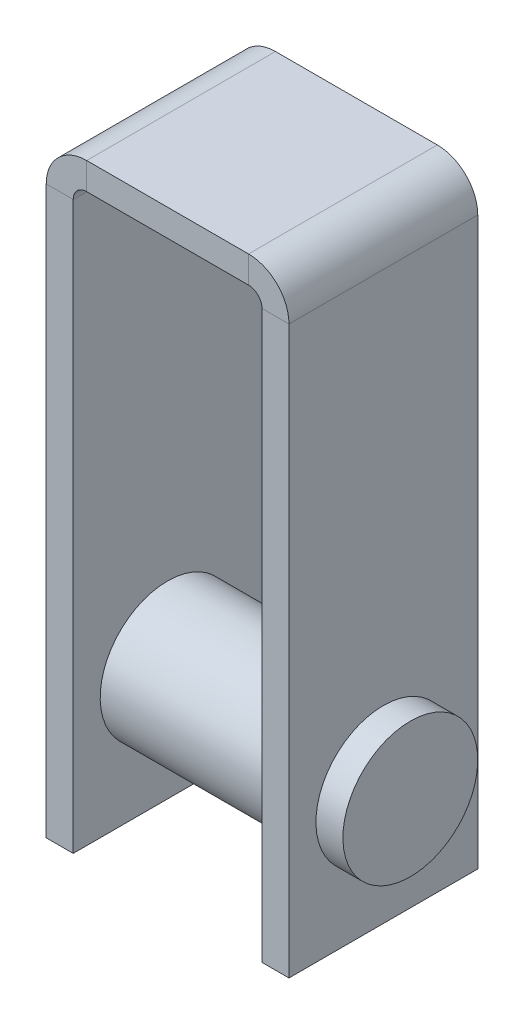
ISO-10303-21;
HEADER;
FILE_DESCRIPTION(('STEP AP214'),'2;1');
FILE_NAME('part.step','',(''),(''),'','','');
FILE_SCHEMA(('AUTOMOTIVE_DESIGN { 1 0 10303 214 1 1 1 1 }'));
ENDSEC;
DATA;
#1=APPLICATION_CONTEXT('core data for automotive mechanical design processes');
#2=APPLICATION_PROTOCOL_DEFINITION('international standard','automotive_design',2000,#1);
#3=PRODUCT_CONTEXT('',#1,'mechanical');
#4=PRODUCT('Part','Part','',(#3));
#5=PRODUCT_RELATED_PRODUCT_CATEGORY('part','',(#4));
#6=PRODUCT_DEFINITION_FORMATION('','',#4);
#7=PRODUCT_DEFINITION_CONTEXT('part definition',#1,'design');
#8=PRODUCT_DEFINITION('design','',#6,#7);
#9=PRODUCT_DEFINITION_SHAPE('','',#8);
#10=(LENGTH_UNIT() NAMED_UNIT(*) SI_UNIT(.MILLI.,.METRE.));
#11=(NAMED_UNIT(*) PLANE_ANGLE_UNIT() SI_UNIT($,.RADIAN.));
#12=(NAMED_UNIT(*) SI_UNIT($,.STERADIAN.) SOLID_ANGLE_UNIT());
#13=UNCERTAINTY_MEASURE_WITH_UNIT(LENGTH_MEASURE(1.E-05),#10,'distance_accuracy_value','');
#14=(GEOMETRIC_REPRESENTATION_CONTEXT(3) GLOBAL_UNCERTAINTY_ASSIGNED_CONTEXT((#13)) GLOBAL_UNIT_ASSIGNED_CONTEXT((#10,
#11,#12)) REPRESENTATION_CONTEXT('',''));
#15=CARTESIAN_POINT('',(0.,0.,0.));
#16=DIRECTION('',(0.,0.,1.));
#17=DIRECTION('',(1.,0.,0.));
#18=AXIS2_PLACEMENT_3D('',#15,#16,#17);
#19=CARTESIAN_POINT('',(-31.6451788984849,-220.,0.));
#20=DIRECTION('',(0.,-1.,0.));
#21=DIRECTION('',(0.,0.,1.));
#22=AXIS2_PLACEMENT_3D('',#19,#20,#21);
#23=PLANE('',#22);
#24=DIRECTION('',(-1.,0.,0.));
#25=VECTOR('',#24,1.);
#26=CARTESIAN_POINT('',(-26.6451788984849,-220.,-35.));
#27=LINE('',#26,#25);
#28=CARTESIAN_POINT('',(-26.6451788984849,-220.,-35.));
#29=VERTEX_POINT('',#28);
#30=CARTESIAN_POINT('',(-36.6451788984849,-220.,-35.));
#31=VERTEX_POINT('',#30);
#32=EDGE_CURVE('E148',#29,#31,#27,.T.);
#33=ORIENTED_EDGE('',*,*,#32,.F.);
#34=DIRECTION('',(0.,0.,-1.));
#35=VECTOR('',#34,1.);
#36=CARTESIAN_POINT('',(-26.6451788984849,-220.,35.));
#37=LINE('',#36,#35);
#38=CARTESIAN_POINT('',(-26.6451788984849,-220.,35.));
#39=VERTEX_POINT('',#38);
#40=EDGE_CURVE('E150',#39,#29,#37,.T.);
#41=ORIENTED_EDGE('',*,*,#40,.F.);
#42=DIRECTION('',(1.,0.,0.));
#43=VECTOR('',#42,1.);
#44=CARTESIAN_POINT('',(-26.6451788984849,-220.,35.));
#45=LINE('',#44,#43);
#46=CARTESIAN_POINT('',(-36.6451788984849,-220.,35.));
#47=VERTEX_POINT('',#46);
#48=EDGE_CURVE('E168',#47,#39,#45,.T.);
#49=ORIENTED_EDGE('',*,*,#48,.F.);
#50=DIRECTION('',(0.,0.,1.));
#51=VECTOR('',#50,1.);
#52=CARTESIAN_POINT('',(-36.6451788984849,-220.,35.));
#53=LINE('',#52,#51);
#54=EDGE_CURVE('E153',#31,#47,#53,.T.);
#55=ORIENTED_EDGE('',*,*,#54,.F.);
#56=EDGE_LOOP('',(#33,#41,#49,#55));
#57=FACE_BOUND('',#56,.T.);
#58=ADVANCED_FACE('F39',(#57),#23,.T.);
#59=CARTESIAN_POINT('',(48.3548211015151,-220.,0.));
#60=DIRECTION('',(0.,1.,0.));
#61=DIRECTION('',(0.,0.,1.));
#62=AXIS2_PLACEMENT_3D('',#59,#60,#61);
#63=PLANE('',#62);
#64=DIRECTION('',(1.,0.,0.));
#65=VECTOR('',#64,1.);
#66=CARTESIAN_POINT('',(43.3548211015151,-220.,-35.));
#67=LINE('',#66,#65);
#68=CARTESIAN_POINT('',(43.3548211015151,-220.,-35.));
#69=VERTEX_POINT('',#68);
#70=CARTESIAN_POINT('',(53.3548211015151,-220.,-35.));
#71=VERTEX_POINT('',#70);
#72=EDGE_CURVE('E209',#69,#71,#67,.T.);
#73=ORIENTED_EDGE('',*,*,#72,.T.);
#74=DIRECTION('',(0.,0.,1.));
#75=VECTOR('',#74,1.);
#76=CARTESIAN_POINT('',(53.3548211015151,-220.,35.));
#77=LINE('',#76,#75);
#78=CARTESIAN_POINT('',(53.3548211015151,-220.,35.));
#79=VERTEX_POINT('',#78);
#80=EDGE_CURVE('E59',#71,#79,#77,.T.);
#81=ORIENTED_EDGE('',*,*,#80,.T.);
#82=DIRECTION('',(-1.,0.,0.));
#83=VECTOR('',#82,1.);
#84=CARTESIAN_POINT('',(43.3548211015151,-220.,35.));
#85=LINE('',#84,#83);
#86=CARTESIAN_POINT('',(43.3548211015151,-220.,35.));
#87=VERTEX_POINT('',#86);
#88=EDGE_CURVE('E53',#79,#87,#85,.T.);
#89=ORIENTED_EDGE('',*,*,#88,.T.);
#90=DIRECTION('',(0.,0.,-1.));
#91=VECTOR('',#90,1.);
#92=CARTESIAN_POINT('',(43.3548211015151,-220.,35.));
#93=LINE('',#92,#91);
#94=EDGE_CURVE('E11',#87,#69,#93,.T.);
#95=ORIENTED_EDGE('',*,*,#94,.T.);
#96=EDGE_LOOP('',(#73,#81,#89,#95));
#97=FACE_BOUND('',#96,.T.);
#98=ADVANCED_FACE('F300',(#97),#63,.F.);
#99=CARTESIAN_POINT('',(-26.6451788984849,-220.,-35.));
#100=DIRECTION('',(0.,0.,-1.));
#101=DIRECTION('',(-1.,0.,0.));
#102=AXIS2_PLACEMENT_3D('',#99,#100,#101);
#103=PLANE('',#102);
#104=DIRECTION('',(0.,1.,0.));
#105=VECTOR('',#104,1.);
#106=CARTESIAN_POINT('',(-36.6451788984849,-220.,-35.));
#107=LINE('',#106,#105);
#108=CARTESIAN_POINT('',(-36.6451788984849,-10.0000000000001,-35.));
#109=VERTEX_POINT('',#108);
#110=EDGE_CURVE('E175',#31,#109,#107,.T.);
#111=ORIENTED_EDGE('',*,*,#110,.T.);
#112=DIRECTION('',(-1.,0.,0.));
#113=VECTOR('',#112,1.);
#114=CARTESIAN_POINT('',(-26.6451788984849,-10.0000000000001,-35.));
#115=LINE('',#114,#113);
#116=CARTESIAN_POINT('',(-26.6451788984849,-10.0000000000001,-35.));
#117=VERTEX_POINT('',#116);
#118=EDGE_CURVE('E173',#117,#109,#115,.T.);
#119=ORIENTED_EDGE('',*,*,#118,.F.);
#120=DIRECTION('',(0.,1.,0.));
#121=VECTOR('',#120,1.);
#122=CARTESIAN_POINT('',(-26.6451788984849,-220.,-35.));
#123=LINE('',#122,#121);
#124=EDGE_CURVE('E165',#29,#117,#123,.T.);
#125=ORIENTED_EDGE('',*,*,#124,.F.);
#126=ORIENTED_EDGE('',*,*,#32,.T.);
#127=EDGE_LOOP('',(#111,#119,#125,#126));
#128=FACE_BOUND('',#127,.T.);
#129=ADVANCED_FACE('F171',(#128),#103,.T.);
#130=CARTESIAN_POINT('',(-36.6451788984849,-220.,35.));
#131=DIRECTION('',(-1.,0.,0.));
#132=DIRECTION('',(0.,-1.,0.));
#133=AXIS2_PLACEMENT_3D('',#130,#131,#132);
#134=PLANE('',#133);
#135=CARTESIAN_POINT('',(-36.6451788984849,-175.,0.));
#136=DIRECTION('',(-1.,0.,0.));
#137=DIRECTION('',(0.,-1.,0.));
#138=AXIS2_PLACEMENT_3D('',#135,#136,#137);
#139=CIRCLE('',#138,25.);
#140=CARTESIAN_POINT('',(-36.6451788984849,-200.,0.));
#141=VERTEX_POINT('',#140);
#142=EDGE_CURVE('E539',#141,#141,#139,.T.);
#143=ORIENTED_EDGE('',*,*,#142,.F.);
#144=EDGE_LOOP('',(#143));
#145=FACE_BOUND('',#144,.T.);
#146=DIRECTION('',(0.,1.,0.));
#147=VECTOR('',#146,1.);
#148=CARTESIAN_POINT('',(-36.6451788984849,-220.,35.));
#149=LINE('',#148,#147);
#150=CARTESIAN_POINT('',(-36.6451788984849,-10.0000000000001,35.));
#151=VERTEX_POINT('',#150);
#152=EDGE_CURVE('E220',#47,#151,#149,.T.);
#153=ORIENTED_EDGE('',*,*,#152,.T.);
#154=DIRECTION('',(0.,0.,1.));
#155=VECTOR('',#154,1.);
#156=CARTESIAN_POINT('',(-36.6451788984849,-10.0000000000001,35.));
#157=LINE('',#156,#155);
#158=EDGE_CURVE('E217',#109,#151,#157,.T.);
#159=ORIENTED_EDGE('',*,*,#158,.F.);
#160=ORIENTED_EDGE('',*,*,#110,.F.);
#161=ORIENTED_EDGE('',*,*,#54,.T.);
#162=EDGE_LOOP('',(#153,#159,#160,#161));
#163=FACE_BOUND('',#162,.T.);
#164=ADVANCED_FACE('F338',(#145,#163),#134,.T.);
#165=CARTESIAN_POINT('',(-26.6451788984849,-220.,35.));
#166=DIRECTION('',(0.,0.,1.));
#167=DIRECTION('',(1.,0.,0.));
#168=AXIS2_PLACEMENT_3D('',#165,#166,#167);
#169=PLANE('',#168);
#170=DIRECTION('',(0.,1.,0.));
#171=VECTOR('',#170,1.);
#172=CARTESIAN_POINT('',(-26.6451788984849,-220.,35.));
#173=LINE('',#172,#171);
#174=CARTESIAN_POINT('',(-26.6451788984849,-10.0000000000001,35.));
#175=VERTEX_POINT('',#174);
#176=EDGE_CURVE('E167',#39,#175,#173,.T.);
#177=ORIENTED_EDGE('',*,*,#176,.T.);
#178=DIRECTION('',(1.,0.,0.));
#179=VECTOR('',#178,1.);
#180=CARTESIAN_POINT('',(-26.6451788984849,-10.0000000000001,35.));
#181=LINE('',#180,#179);
#182=EDGE_CURVE('E223',#151,#175,#181,.T.);
#183=ORIENTED_EDGE('',*,*,#182,.F.);
#184=ORIENTED_EDGE('',*,*,#152,.F.);
#185=ORIENTED_EDGE('',*,*,#48,.T.);
#186=EDGE_LOOP('',(#177,#183,#184,#185));
#187=FACE_BOUND('',#186,.T.);
#188=ADVANCED_FACE('F285',(#187),#169,.T.);
#189=CARTESIAN_POINT('',(-26.6451788984849,-220.,35.));
#190=DIRECTION('',(1.,0.,0.));
#191=DIRECTION('',(0.,1.,0.));
#192=AXIS2_PLACEMENT_3D('',#189,#190,#191);
#193=PLANE('',#192);
#194=CARTESIAN_POINT('',(-26.6451788984849,-175.,0.));
#195=DIRECTION('',(1.,0.,0.));
#196=DIRECTION('',(0.,1.,0.));
#197=AXIS2_PLACEMENT_3D('',#194,#195,#196);
#198=CIRCLE('',#197,25.);
#199=CARTESIAN_POINT('',(-26.6451788984849,-150.,0.));
#200=VERTEX_POINT('',#199);
#201=EDGE_CURVE('E158',#200,#200,#198,.T.);
#202=ORIENTED_EDGE('',*,*,#201,.F.);
#203=EDGE_LOOP('',(#202));
#204=FACE_BOUND('',#203,.T.);
#205=DIRECTION('',(0.,0.,-1.));
#206=VECTOR('',#205,1.);
#207=CARTESIAN_POINT('',(-26.6451788984849,-10.0000000000001,35.));
#208=LINE('',#207,#206);
#209=EDGE_CURVE('E188',#175,#117,#208,.T.);
#210=ORIENTED_EDGE('',*,*,#209,.F.);
#211=ORIENTED_EDGE('',*,*,#176,.F.);
#212=ORIENTED_EDGE('',*,*,#40,.T.);
#213=ORIENTED_EDGE('',*,*,#124,.T.);
#214=EDGE_LOOP('',(#210,#211,#212,#213));
#215=FACE_BOUND('',#214,.T.);
#216=ADVANCED_FACE('F164',(#204,#215),#193,.T.);
#217=CARTESIAN_POINT('',(-26.6451788984849,-10.,-35.));
#218=DIRECTION('',(0.,0.,-1.));
#219=DIRECTION('',(-1.,0.,0.));
#220=AXIS2_PLACEMENT_3D('',#217,#218,#219);
#221=PLANE('',#220);
#222=CARTESIAN_POINT('',(-21.6451788984849,-10.,-35.));
#223=DIRECTION('',(0.,0.,-1.));
#224=DIRECTION('',(-1.,0.,0.));
#225=AXIS2_PLACEMENT_3D('',#222,#223,#224);
#226=CIRCLE('',#225,15.);
#227=CARTESIAN_POINT('',(-21.6451788984848,5.00000000000001,-35.));
#228=VERTEX_POINT('',#227);
#229=EDGE_CURVE('E181',#109,#228,#226,.T.);
#230=ORIENTED_EDGE('',*,*,#229,.T.);
#231=DIRECTION('',(0.,1.,0.));
#232=VECTOR('',#231,1.);
#233=CARTESIAN_POINT('',(-21.6451788984848,-5.,-35.));
#234=LINE('',#233,#232);
#235=CARTESIAN_POINT('',(-21.6451788984848,-4.99999999999999,-35.));
#236=VERTEX_POINT('',#235);
#237=EDGE_CURVE('E179',#236,#228,#234,.T.);
#238=ORIENTED_EDGE('',*,*,#237,.F.);
#239=CARTESIAN_POINT('',(-21.6451788984849,-10.,-35.));
#240=DIRECTION('',(0.,0.,-1.));
#241=DIRECTION('',(-1.,0.,0.));
#242=AXIS2_PLACEMENT_3D('',#239,#240,#241);
#243=CIRCLE('',#242,5.);
#244=EDGE_CURVE('E182',#117,#236,#243,.T.);
#245=ORIENTED_EDGE('',*,*,#244,.F.);
#246=ORIENTED_EDGE('',*,*,#118,.T.);
#247=EDGE_LOOP('',(#230,#238,#245,#246));
#248=FACE_BOUND('',#247,.T.);
#249=ADVANCED_FACE('F281',(#248),#221,.T.);
#250=CARTESIAN_POINT('',(-21.6451788984849,-10.,0.));
#251=DIRECTION('',(0.,0.,-1.));
#252=DIRECTION('',(-1.,0.,0.));
#253=AXIS2_PLACEMENT_3D('',#250,#251,#252);
#254=CYLINDRICAL_SURFACE('',#253,15.);
#255=CARTESIAN_POINT('',(-21.6451788984849,-10.,35.));
#256=DIRECTION('',(0.,0.,-1.));
#257=DIRECTION('',(-1.,0.,0.));
#258=AXIS2_PLACEMENT_3D('',#255,#256,#257);
#259=CIRCLE('',#258,15.);
#260=CARTESIAN_POINT('',(-21.6451788984848,5.00000000000001,35.));
#261=VERTEX_POINT('',#260);
#262=EDGE_CURVE('E225',#151,#261,#259,.T.);
#263=ORIENTED_EDGE('',*,*,#262,.T.);
#264=DIRECTION('',(0.,0.,1.));
#265=VECTOR('',#264,1.);
#266=CARTESIAN_POINT('',(-21.6451788984848,5.,35.));
#267=LINE('',#266,#265);
#268=EDGE_CURVE('E185',#228,#261,#267,.T.);
#269=ORIENTED_EDGE('',*,*,#268,.F.);
#270=ORIENTED_EDGE('',*,*,#229,.F.);
#271=ORIENTED_EDGE('',*,*,#158,.T.);
#272=EDGE_LOOP('',(#263,#269,#270,#271));
#273=FACE_BOUND('',#272,.T.);
#274=ADVANCED_FACE('F292',(#273),#254,.T.);
#275=CARTESIAN_POINT('',(-26.6451788984849,-10.,35.));
#276=DIRECTION('',(0.,0.,1.));
#277=DIRECTION('',(1.,0.,0.));
#278=AXIS2_PLACEMENT_3D('',#275,#276,#277);
#279=PLANE('',#278);
#280=CARTESIAN_POINT('',(-21.6451788984849,-10.,35.));
#281=DIRECTION('',(0.,0.,-1.));
#282=DIRECTION('',(-1.,0.,0.));
#283=AXIS2_PLACEMENT_3D('',#280,#281,#282);
#284=CIRCLE('',#283,5.);
#285=CARTESIAN_POINT('',(-21.6451788984848,-4.99999999999999,35.));
#286=VERTEX_POINT('',#285);
#287=EDGE_CURVE('E246',#175,#286,#284,.T.);
#288=ORIENTED_EDGE('',*,*,#287,.T.);
#289=DIRECTION('',(0.,-1.,0.));
#290=VECTOR('',#289,1.);
#291=CARTESIAN_POINT('',(-21.6451788984848,-5.,35.));
#292=LINE('',#291,#290);
#293=EDGE_CURVE('E228',#261,#286,#292,.T.);
#294=ORIENTED_EDGE('',*,*,#293,.F.);
#295=ORIENTED_EDGE('',*,*,#262,.F.);
#296=ORIENTED_EDGE('',*,*,#182,.T.);
#297=EDGE_LOOP('',(#288,#294,#295,#296));
#298=FACE_BOUND('',#297,.T.);
#299=ADVANCED_FACE('F288',(#298),#279,.T.);
#300=CARTESIAN_POINT('',(-21.6451788984849,-10.,0.));
#301=DIRECTION('',(0.,0.,-1.));
#302=DIRECTION('',(-1.,0.,0.));
#303=AXIS2_PLACEMENT_3D('',#300,#301,#302);
#304=CYLINDRICAL_SURFACE('',#303,5.);
#305=DIRECTION('',(0.,0.,-1.));
#306=VECTOR('',#305,1.);
#307=CARTESIAN_POINT('',(-21.6451788984848,-5.,35.));
#308=LINE('',#307,#306);
#309=EDGE_CURVE('E197',#286,#236,#308,.T.);
#310=ORIENTED_EDGE('',*,*,#309,.F.);
#311=ORIENTED_EDGE('',*,*,#287,.F.);
#312=ORIENTED_EDGE('',*,*,#209,.T.);
#313=ORIENTED_EDGE('',*,*,#244,.T.);
#314=EDGE_LOOP('',(#310,#311,#312,#313));
#315=FACE_BOUND('',#314,.T.);
#316=ADVANCED_FACE('F282',(#315),#304,.F.);
#317=CARTESIAN_POINT('',(-21.6451788984848,-5.,-35.));
#318=DIRECTION('',(0.,0.,-1.));
#319=DIRECTION('',(-1.,0.,0.));
#320=AXIS2_PLACEMENT_3D('',#317,#318,#319);
#321=PLANE('',#320);
#322=DIRECTION('',(1.,0.,0.));
#323=VECTOR('',#322,1.);
#324=CARTESIAN_POINT('',(-21.6451788984848,5.,-35.));
#325=LINE('',#324,#323);
#326=CARTESIAN_POINT('',(38.354821101515,5.,-35.));
#327=VERTEX_POINT('',#326);
#328=EDGE_CURVE('E130',#228,#327,#325,.T.);
#329=ORIENTED_EDGE('',*,*,#328,.T.);
#330=DIRECTION('',(0.,1.,0.));
#331=VECTOR('',#330,1.);
#332=CARTESIAN_POINT('',(38.354821101515,-5.,-35.));
#333=LINE('',#332,#331);
#334=CARTESIAN_POINT('',(38.354821101515,-5.,-35.));
#335=VERTEX_POINT('',#334);
#336=EDGE_CURVE('E189',#335,#327,#333,.T.);
#337=ORIENTED_EDGE('',*,*,#336,.F.);
#338=DIRECTION('',(1.,0.,0.));
#339=VECTOR('',#338,1.);
#340=CARTESIAN_POINT('',(-21.6451788984848,-5.,-35.));
#341=LINE('',#340,#339);
#342=EDGE_CURVE('E195',#236,#335,#341,.T.);
#343=ORIENTED_EDGE('',*,*,#342,.F.);
#344=ORIENTED_EDGE('',*,*,#237,.T.);
#345=EDGE_LOOP('',(#329,#337,#343,#344));
#346=FACE_BOUND('',#345,.T.);
#347=ADVANCED_FACE('F275',(#346),#321,.T.);
#348=CARTESIAN_POINT('',(-21.6451788984848,5.,35.));
#349=DIRECTION('',(0.,1.,0.));
#350=DIRECTION('',(0.,0.,1.));
#351=AXIS2_PLACEMENT_3D('',#348,#349,#350);
#352=PLANE('',#351);
#353=DIRECTION('',(1.,0.,0.));
#354=VECTOR('',#353,1.);
#355=CARTESIAN_POINT('',(-21.6451788984848,5.,35.));
#356=LINE('',#355,#354);
#357=CARTESIAN_POINT('',(38.354821101515,5.,35.));
#358=VERTEX_POINT('',#357);
#359=EDGE_CURVE('E123',#261,#358,#356,.T.);
#360=ORIENTED_EDGE('',*,*,#359,.T.);
#361=DIRECTION('',(0.,0.,1.));
#362=VECTOR('',#361,1.);
#363=CARTESIAN_POINT('',(38.354821101515,5.,35.));
#364=LINE('',#363,#362);
#365=EDGE_CURVE('E192',#327,#358,#364,.T.);
#366=ORIENTED_EDGE('',*,*,#365,.F.);
#367=ORIENTED_EDGE('',*,*,#328,.F.);
#368=ORIENTED_EDGE('',*,*,#268,.T.);
#369=EDGE_LOOP('',(#360,#366,#367,#368));
#370=FACE_BOUND('',#369,.T.);
#371=ADVANCED_FACE('F294',(#370),#352,.T.);
#372=CARTESIAN_POINT('',(-21.6451788984848,-5.,35.));
#373=DIRECTION('',(0.,0.,1.));
#374=DIRECTION('',(1.,0.,0.));
#375=AXIS2_PLACEMENT_3D('',#372,#373,#374);
#376=PLANE('',#375);
#377=DIRECTION('',(1.,0.,0.));
#378=VECTOR('',#377,1.);
#379=CARTESIAN_POINT('',(-21.6451788984848,-5.,35.));
#380=LINE('',#379,#378);
#381=CARTESIAN_POINT('',(38.354821101515,-5.,35.));
#382=VERTEX_POINT('',#381);
#383=EDGE_CURVE('E193',#286,#382,#380,.T.);
#384=ORIENTED_EDGE('',*,*,#383,.T.);
#385=DIRECTION('',(0.,-1.,0.));
#386=VECTOR('',#385,1.);
#387=CARTESIAN_POINT('',(38.354821101515,-5.,35.));
#388=LINE('',#387,#386);
#389=EDGE_CURVE('E231',#358,#382,#388,.T.);
#390=ORIENTED_EDGE('',*,*,#389,.F.);
#391=ORIENTED_EDGE('',*,*,#359,.F.);
#392=ORIENTED_EDGE('',*,*,#293,.T.);
#393=EDGE_LOOP('',(#384,#390,#391,#392));
#394=FACE_BOUND('',#393,.T.);
#395=ADVANCED_FACE('F306',(#394),#376,.T.);
#396=CARTESIAN_POINT('',(-21.6451788984848,-5.,35.));
#397=DIRECTION('',(0.,-1.,0.));
#398=DIRECTION('',(0.,0.,-1.));
#399=AXIS2_PLACEMENT_3D('',#396,#397,#398);
#400=PLANE('',#399);
#401=DIRECTION('',(0.,0.,-1.));
#402=VECTOR('',#401,1.);
#403=CARTESIAN_POINT('',(38.354821101515,-5.,35.));
#404=LINE('',#403,#402);
#405=EDGE_CURVE('E208',#382,#335,#404,.T.);
#406=ORIENTED_EDGE('',*,*,#405,.F.);
#407=ORIENTED_EDGE('',*,*,#383,.F.);
#408=ORIENTED_EDGE('',*,*,#309,.T.);
#409=ORIENTED_EDGE('',*,*,#342,.T.);
#410=EDGE_LOOP('',(#406,#407,#408,#409));
#411=FACE_BOUND('',#410,.T.);
#412=ADVANCED_FACE('F278',(#411),#400,.T.);
#413=CARTESIAN_POINT('',(38.354821101515,-5.,-35.));
#414=DIRECTION('',(0.,0.,-1.));
#415=DIRECTION('',(-1.,0.,0.));
#416=AXIS2_PLACEMENT_3D('',#413,#414,#415);
#417=PLANE('',#416);
#418=CARTESIAN_POINT('',(38.3548211015151,-10.,-35.));
#419=DIRECTION('',(0.,0.,-1.));
#420=DIRECTION('',(0.,1.,0.));
#421=AXIS2_PLACEMENT_3D('',#418,#419,#420);
#422=CIRCLE('',#421,15.);
#423=CARTESIAN_POINT('',(53.3548211015151,-10.,-35.));
#424=VERTEX_POINT('',#423);
#425=EDGE_CURVE('E201',#327,#424,#422,.T.);
#426=ORIENTED_EDGE('',*,*,#425,.T.);
#427=DIRECTION('',(1.,0.,0.));
#428=VECTOR('',#427,1.);
#429=CARTESIAN_POINT('',(43.3548211015151,-10.,-35.));
#430=LINE('',#429,#428);
#431=CARTESIAN_POINT('',(43.3548211015151,-10.,-35.));
#432=VERTEX_POINT('',#431);
#433=EDGE_CURVE('E198',#432,#424,#430,.T.);
#434=ORIENTED_EDGE('',*,*,#433,.F.);
#435=CARTESIAN_POINT('',(38.3548211015151,-10.,-35.));
#436=DIRECTION('',(0.,0.,-1.));
#437=DIRECTION('',(0.,1.,0.));
#438=AXIS2_PLACEMENT_3D('',#435,#436,#437);
#439=CIRCLE('',#438,5.);
#440=EDGE_CURVE('E202',#335,#432,#439,.T.);
#441=ORIENTED_EDGE('',*,*,#440,.F.);
#442=ORIENTED_EDGE('',*,*,#336,.T.);
#443=EDGE_LOOP('',(#426,#434,#441,#442));
#444=FACE_BOUND('',#443,.T.);
#445=ADVANCED_FACE('F270',(#444),#417,.T.);
#446=CARTESIAN_POINT('',(38.3548211015151,-10.,0.));
#447=DIRECTION('',(0.,0.,-1.));
#448=DIRECTION('',(-1.,0.,0.));
#449=AXIS2_PLACEMENT_3D('',#446,#447,#448);
#450=CYLINDRICAL_SURFACE('',#449,15.);
#451=CARTESIAN_POINT('',(38.3548211015151,-10.,35.));
#452=DIRECTION('',(0.,0.,-1.));
#453=DIRECTION('',(0.,1.,0.));
#454=AXIS2_PLACEMENT_3D('',#451,#452,#453);
#455=CIRCLE('',#454,15.);
#456=CARTESIAN_POINT('',(53.3548211015151,-10.,35.));
#457=VERTEX_POINT('',#456);
#458=EDGE_CURVE('E234',#358,#457,#455,.T.);
#459=ORIENTED_EDGE('',*,*,#458,.T.);
#460=DIRECTION('',(0.,0.,1.));
#461=VECTOR('',#460,1.);
#462=CARTESIAN_POINT('',(53.3548211015151,-10.,35.));
#463=LINE('',#462,#461);
#464=EDGE_CURVE('E205',#424,#457,#463,.T.);
#465=ORIENTED_EDGE('',*,*,#464,.F.);
#466=ORIENTED_EDGE('',*,*,#425,.F.);
#467=ORIENTED_EDGE('',*,*,#365,.T.);
#468=EDGE_LOOP('',(#459,#465,#466,#467));
#469=FACE_BOUND('',#468,.T.);
#470=ADVANCED_FACE('F296',(#469),#450,.T.);
#471=CARTESIAN_POINT('',(38.354821101515,-5.,35.));
#472=DIRECTION('',(0.,0.,1.));
#473=DIRECTION('',(1.,0.,0.));
#474=AXIS2_PLACEMENT_3D('',#471,#472,#473);
#475=PLANE('',#474);
#476=CARTESIAN_POINT('',(38.3548211015151,-10.,35.));
#477=DIRECTION('',(0.,0.,-1.));
#478=DIRECTION('',(0.,1.,0.));
#479=AXIS2_PLACEMENT_3D('',#476,#477,#478);
#480=CIRCLE('',#479,5.);
#481=CARTESIAN_POINT('',(43.3548211015151,-10.,35.));
#482=VERTEX_POINT('',#481);
#483=EDGE_CURVE('E253',#382,#482,#480,.T.);
#484=ORIENTED_EDGE('',*,*,#483,.T.);
#485=DIRECTION('',(-1.,0.,0.));
#486=VECTOR('',#485,1.);
#487=CARTESIAN_POINT('',(43.3548211015151,-10.,35.));
#488=LINE('',#487,#486);
#489=EDGE_CURVE('E237',#457,#482,#488,.T.);
#490=ORIENTED_EDGE('',*,*,#489,.F.);
#491=ORIENTED_EDGE('',*,*,#458,.F.);
#492=ORIENTED_EDGE('',*,*,#389,.T.);
#493=EDGE_LOOP('',(#484,#490,#491,#492));
#494=FACE_BOUND('',#493,.T.);
#495=ADVANCED_FACE('F303',(#494),#475,.T.);
#496=CARTESIAN_POINT('',(38.3548211015151,-10.,0.));
#497=DIRECTION('',(0.,0.,-1.));
#498=DIRECTION('',(-1.,0.,0.));
#499=AXIS2_PLACEMENT_3D('',#496,#497,#498);
#500=CYLINDRICAL_SURFACE('',#499,5.);
#501=DIRECTION('',(0.,0.,-1.));
#502=VECTOR('',#501,1.);
#503=CARTESIAN_POINT('',(43.3548211015151,-10.,35.));
#504=LINE('',#503,#502);
#505=EDGE_CURVE('E215',#482,#432,#504,.T.);
#506=ORIENTED_EDGE('',*,*,#505,.F.);
#507=ORIENTED_EDGE('',*,*,#483,.F.);
#508=ORIENTED_EDGE('',*,*,#405,.T.);
#509=ORIENTED_EDGE('',*,*,#440,.T.);
#510=EDGE_LOOP('',(#506,#507,#508,#509));
#511=FACE_BOUND('',#510,.T.);
#512=ADVANCED_FACE('F272',(#511),#500,.F.);
#513=CARTESIAN_POINT('',(43.3548211015151,-10.0000000000001,-35.));
#514=DIRECTION('',(0.,0.,-1.));
#515=DIRECTION('',(-1.,0.,0.));
#516=AXIS2_PLACEMENT_3D('',#513,#514,#515);
#517=PLANE('',#516);
#518=DIRECTION('',(0.,-1.,0.));
#519=VECTOR('',#518,1.);
#520=CARTESIAN_POINT('',(53.3548211015151,-10.0000000000001,-35.));
#521=LINE('',#520,#519);
#522=EDGE_CURVE('E104',#424,#71,#521,.T.);
#523=ORIENTED_EDGE('',*,*,#522,.T.);
#524=ORIENTED_EDGE('',*,*,#72,.F.);
#525=DIRECTION('',(0.,-1.,0.));
#526=VECTOR('',#525,1.);
#527=CARTESIAN_POINT('',(43.3548211015151,-10.0000000000001,-35.));
#528=LINE('',#527,#526);
#529=EDGE_CURVE('E211',#432,#69,#528,.T.);
#530=ORIENTED_EDGE('',*,*,#529,.F.);
#531=ORIENTED_EDGE('',*,*,#433,.T.);
#532=EDGE_LOOP('',(#523,#524,#530,#531));
#533=FACE_BOUND('',#532,.T.);
#534=ADVANCED_FACE('F299',(#533),#517,.T.);
#535=CARTESIAN_POINT('',(53.3548211015151,-10.0000000000001,35.));
#536=DIRECTION('',(1.,0.,0.));
#537=DIRECTION('',(0.,1.,0.));
#538=AXIS2_PLACEMENT_3D('',#535,#536,#537);
#539=PLANE('',#538);
#540=CARTESIAN_POINT('',(53.3548211015151,-175.,0.));
#541=DIRECTION('',(1.,0.,0.));
#542=DIRECTION('',(0.,1.,0.));
#543=AXIS2_PLACEMENT_3D('',#540,#541,#542);
#544=CIRCLE('',#543,25.);
#545=CARTESIAN_POINT('',(53.3548211015151,-150.,0.));
#546=VERTEX_POINT('',#545);
#547=EDGE_CURVE('E543',#546,#546,#544,.T.);
#548=ORIENTED_EDGE('',*,*,#547,.F.);
#549=EDGE_LOOP('',(#548));
#550=FACE_BOUND('',#549,.T.);
#551=DIRECTION('',(0.,-1.,0.));
#552=VECTOR('',#551,1.);
#553=CARTESIAN_POINT('',(53.3548211015151,-10.0000000000001,35.));
#554=LINE('',#553,#552);
#555=EDGE_CURVE('E97',#457,#79,#554,.T.);
#556=ORIENTED_EDGE('',*,*,#555,.T.);
#557=ORIENTED_EDGE('',*,*,#80,.F.);
#558=ORIENTED_EDGE('',*,*,#522,.F.);
#559=ORIENTED_EDGE('',*,*,#464,.T.);
#560=EDGE_LOOP('',(#556,#557,#558,#559));
#561=FACE_BOUND('',#560,.T.);
#562=ADVANCED_FACE('F297',(#550,#561),#539,.T.);
#563=CARTESIAN_POINT('',(43.3548211015151,-10.0000000000001,35.));
#564=DIRECTION('',(0.,0.,1.));
#565=DIRECTION('',(1.,0.,0.));
#566=AXIS2_PLACEMENT_3D('',#563,#564,#565);
#567=PLANE('',#566);
#568=DIRECTION('',(0.,-1.,0.));
#569=VECTOR('',#568,1.);
#570=CARTESIAN_POINT('',(43.3548211015151,-10.0000000000001,35.));
#571=LINE('',#570,#569);
#572=EDGE_CURVE('E47',#482,#87,#571,.T.);
#573=ORIENTED_EDGE('',*,*,#572,.T.);
#574=ORIENTED_EDGE('',*,*,#88,.F.);
#575=ORIENTED_EDGE('',*,*,#555,.F.);
#576=ORIENTED_EDGE('',*,*,#489,.T.);
#577=EDGE_LOOP('',(#573,#574,#575,#576));
#578=FACE_BOUND('',#577,.T.);
#579=ADVANCED_FACE('F301',(#578),#567,.T.);
#580=CARTESIAN_POINT('',(43.3548211015151,-10.0000000000001,35.));
#581=DIRECTION('',(-1.,0.,0.));
#582=DIRECTION('',(0.,-1.,0.));
#583=AXIS2_PLACEMENT_3D('',#580,#581,#582);
#584=PLANE('',#583);
#585=CARTESIAN_POINT('',(43.3548211015151,-175.,0.));
#586=DIRECTION('',(-1.,0.,0.));
#587=DIRECTION('',(0.,-1.,0.));
#588=AXIS2_PLACEMENT_3D('',#585,#586,#587);
#589=CIRCLE('',#588,25.);
#590=CARTESIAN_POINT('',(43.3548211015151,-200.,0.));
#591=VERTEX_POINT('',#590);
#592=EDGE_CURVE('E42',#591,#591,#589,.T.);
#593=ORIENTED_EDGE('',*,*,#592,.F.);
#594=EDGE_LOOP('',(#593));
#595=FACE_BOUND('',#594,.T.);
#596=ORIENTED_EDGE('',*,*,#94,.F.);
#597=ORIENTED_EDGE('',*,*,#572,.F.);
#598=ORIENTED_EDGE('',*,*,#505,.T.);
#599=ORIENTED_EDGE('',*,*,#529,.T.);
#600=EDGE_LOOP('',(#596,#597,#598,#599));
#601=FACE_BOUND('',#600,.T.);
#602=ADVANCED_FACE('F265',(#595,#601),#584,.T.);
#603=CARTESIAN_POINT('',(-46.6451788984849,-175.,0.));
#604=DIRECTION('',(1.,0.,0.));
#605=DIRECTION('',(0.,1.,0.));
#606=AXIS2_PLACEMENT_3D('',#603,#604,#605);
#607=CYLINDRICAL_SURFACE('',#606,25.);
#608=ORIENTED_EDGE('',*,*,#201,.T.);
#609=EDGE_LOOP('',(#608));
#610=FACE_BOUND('',#609,.T.);
#611=ORIENTED_EDGE('',*,*,#592,.T.);
#612=EDGE_LOOP('',(#611));
#613=FACE_BOUND('',#612,.T.);
#614=ADVANCED_FACE('F318',(#610,#613),#607,.T.);
#615=CARTESIAN_POINT('',(63.3548211015151,-175.,0.));
#616=DIRECTION('',(1.,0.,0.));
#617=DIRECTION('',(0.,1.,0.));
#618=AXIS2_PLACEMENT_3D('',#615,#616,#617);
#619=PLANE('',#618);
#620=CARTESIAN_POINT('',(63.3548211015151,-175.,0.));
#621=DIRECTION('',(1.,0.,0.));
#622=DIRECTION('',(0.,1.,0.));
#623=AXIS2_PLACEMENT_3D('',#620,#621,#622);
#624=CIRCLE('',#623,25.);
#625=CARTESIAN_POINT('',(63.3548211015151,-150.,0.));
#626=VERTEX_POINT('',#625);
#627=EDGE_CURVE('E540',#626,#626,#624,.T.);
#628=ORIENTED_EDGE('',*,*,#627,.T.);
#629=EDGE_LOOP('',(#628));
#630=FACE_BOUND('',#629,.T.);
#631=ADVANCED_FACE('F325',(#630),#619,.T.);
#632=ORIENTED_EDGE('',*,*,#547,.T.);
#633=EDGE_LOOP('',(#632));
#634=FACE_BOUND('',#633,.T.);
#635=ORIENTED_EDGE('',*,*,#627,.F.);
#636=EDGE_LOOP('',(#635));
#637=FACE_BOUND('',#636,.T.);
#638=ADVANCED_FACE('F329',(#634,#637),#607,.T.);
#639=ORIENTED_EDGE('',*,*,#142,.T.);
#640=EDGE_LOOP('',(#639));
#641=FACE_BOUND('',#640,.T.);
#642=CARTESIAN_POINT('',(-46.6451788984849,-175.,0.));
#643=DIRECTION('',(1.,0.,0.));
#644=DIRECTION('',(0.,1.,0.));
#645=AXIS2_PLACEMENT_3D('',#642,#643,#644);
#646=CIRCLE('',#645,25.);
#647=CARTESIAN_POINT('',(-46.6451788984849,-150.,0.));
#648=VERTEX_POINT('',#647);
#649=EDGE_CURVE('E537',#648,#648,#646,.T.);
#650=ORIENTED_EDGE('',*,*,#649,.T.);
#651=EDGE_LOOP('',(#650));
#652=FACE_BOUND('',#651,.T.);
#653=ADVANCED_FACE('F328',(#641,#652),#607,.T.);
#654=CARTESIAN_POINT('',(-46.6451788984849,-175.,0.));
#655=DIRECTION('',(1.,0.,0.));
#656=DIRECTION('',(0.,1.,0.));
#657=AXIS2_PLACEMENT_3D('',#654,#655,#656);
#658=PLANE('',#657);
#659=ORIENTED_EDGE('',*,*,#649,.F.);
#660=EDGE_LOOP('',(#659));
#661=FACE_BOUND('',#660,.T.);
#662=ADVANCED_FACE('F522',(#661),#658,.F.);
#663=CLOSED_SHELL('',(#58,#98,#129,#164,#188,#216,#249,#274,#299,#316,#347,#371,#395,#412,#445,
#470,#495,#512,#534,#562,#579,#602,#614,#631,#638,#653,#662));
#664=MANIFOLD_SOLID_BREP('B2',#663);
#665=ADVANCED_BREP_SHAPE_REPRESENTATION('',(#18,#664),#14);
#666=SHAPE_DEFINITION_REPRESENTATION(#9,#665);
ENDSEC;
END-ISO-10303-21;
